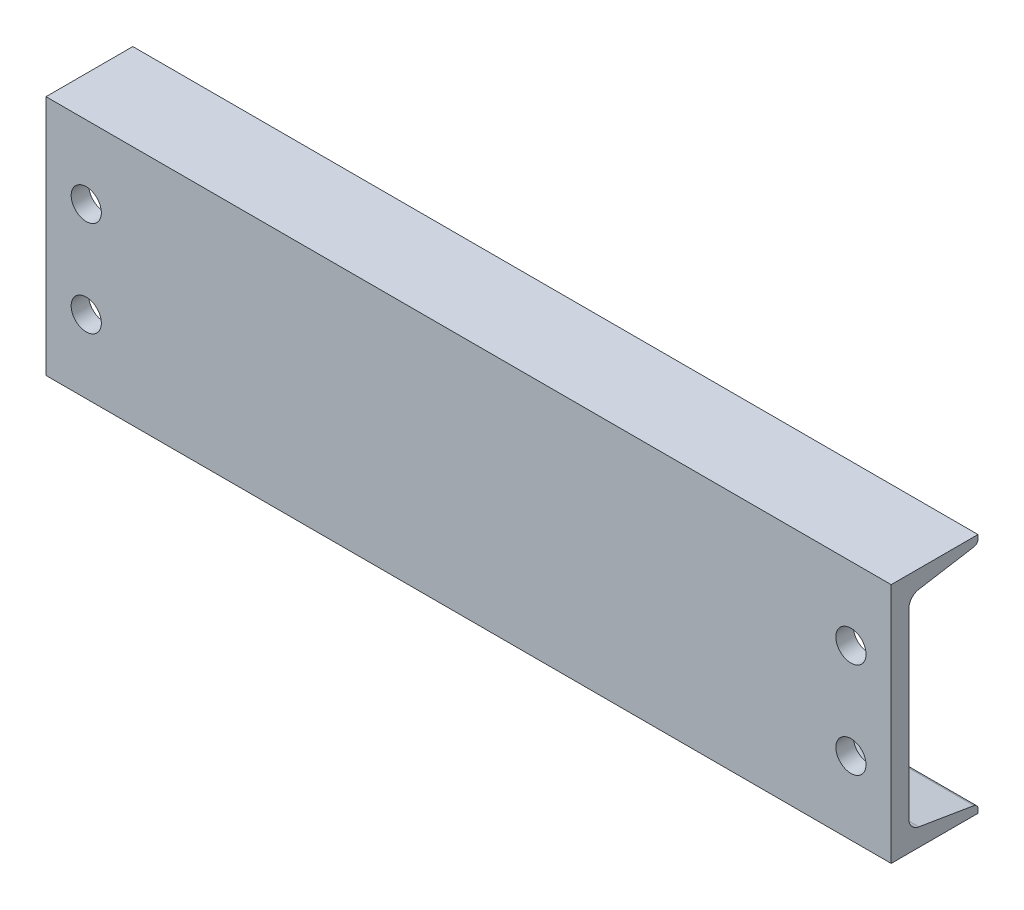
ISO-10303-21;
HEADER;
FILE_DESCRIPTION(('STEP AP214'),'2;1');
FILE_NAME('part.step','',(''),(''),'','','');
FILE_SCHEMA(('AUTOMOTIVE_DESIGN { 1 0 10303 214 1 1 1 1 }'));
ENDSEC;
DATA;
#1=APPLICATION_CONTEXT('core data for automotive mechanical design processes');
#2=APPLICATION_PROTOCOL_DEFINITION('international standard','automotive_design',2000,#1);
#3=PRODUCT_CONTEXT('',#1,'mechanical');
#4=PRODUCT('Part','Part','',(#3));
#5=PRODUCT_RELATED_PRODUCT_CATEGORY('part','',(#4));
#6=PRODUCT_DEFINITION_FORMATION('','',#4);
#7=PRODUCT_DEFINITION_CONTEXT('part definition',#1,'design');
#8=PRODUCT_DEFINITION('design','',#6,#7);
#9=PRODUCT_DEFINITION_SHAPE('','',#8);
#10=(LENGTH_UNIT() NAMED_UNIT(*) SI_UNIT(.MILLI.,.METRE.));
#11=(NAMED_UNIT(*) PLANE_ANGLE_UNIT() SI_UNIT($,.RADIAN.));
#12=(NAMED_UNIT(*) SI_UNIT($,.STERADIAN.) SOLID_ANGLE_UNIT());
#13=UNCERTAINTY_MEASURE_WITH_UNIT(LENGTH_MEASURE(1.E-05),#10,'distance_accuracy_value','');
#14=(GEOMETRIC_REPRESENTATION_CONTEXT(3) GLOBAL_UNCERTAINTY_ASSIGNED_CONTEXT((#13)) GLOBAL_UNIT_ASSIGNED_CONTEXT((#10,
#11,#12)) REPRESENTATION_CONTEXT('',''));
#15=CARTESIAN_POINT('',(0.,0.,0.));
#16=DIRECTION('',(0.,0.,1.));
#17=DIRECTION('',(1.,0.,0.));
#18=AXIS2_PLACEMENT_3D('',#15,#16,#17);
#19=CARTESIAN_POINT('',(266.7,-76.2,27.3939));
#20=DIRECTION('',(0.,1.,0.));
#21=DIRECTION('',(0.,0.,1.));
#22=AXIS2_PLACEMENT_3D('',#19,#20,#21);
#23=PLANE('',#22);
#24=DIRECTION('',(0.,0.,-1.));
#25=VECTOR('',#24,1.);
#26=CARTESIAN_POINT('',(-266.7,-76.2,27.3939));
#27=LINE('',#26,#25);
#28=CARTESIAN_POINT('',(-266.7,-76.2,27.3939));
#29=VERTEX_POINT('',#28);
#30=CARTESIAN_POINT('',(-266.7,-76.2,-27.3939));
#31=VERTEX_POINT('',#30);
#32=EDGE_CURVE('E160',#29,#31,#27,.T.);
#33=ORIENTED_EDGE('',*,*,#32,.T.);
#34=DIRECTION('',(-1.,0.,0.));
#35=VECTOR('',#34,1.);
#36=CARTESIAN_POINT('',(266.7,-76.2,-27.3939));
#37=LINE('',#36,#35);
#38=CARTESIAN_POINT('',(266.7,-76.2,-27.3939));
#39=VERTEX_POINT('',#38);
#40=EDGE_CURVE('E11',#39,#31,#37,.T.);
#41=ORIENTED_EDGE('',*,*,#40,.F.);
#42=DIRECTION('',(0.,0.,-1.));
#43=VECTOR('',#42,1.);
#44=CARTESIAN_POINT('',(266.7,-76.2,27.3939));
#45=LINE('',#44,#43);
#46=CARTESIAN_POINT('',(266.7,-76.2,27.3939));
#47=VERTEX_POINT('',#46);
#48=EDGE_CURVE('E183',#47,#39,#45,.T.);
#49=ORIENTED_EDGE('',*,*,#48,.F.);
#50=DIRECTION('',(-1.,0.,0.));
#51=VECTOR('',#50,1.);
#52=CARTESIAN_POINT('',(266.7,-76.2,27.3939));
#53=LINE('',#52,#51);
#54=EDGE_CURVE('E156',#47,#29,#53,.T.);
#55=ORIENTED_EDGE('',*,*,#54,.T.);
#56=EDGE_LOOP('',(#33,#41,#49,#55));
#57=FACE_BOUND('',#56,.T.);
#58=ADVANCED_FACE('F40',(#57),#23,.F.);
#59=CARTESIAN_POINT('',(266.7,-76.2,-27.3939));
#60=DIRECTION('',(0.,0.,1.));
#61=DIRECTION('',(1.,0.,0.));
#62=AXIS2_PLACEMENT_3D('',#59,#60,#61);
#63=PLANE('',#62);
#64=DIRECTION('',(0.,1.,0.));
#65=VECTOR('',#64,1.);
#66=CARTESIAN_POINT('',(-266.7,-76.2,-27.3939));
#67=LINE('',#66,#65);
#68=CARTESIAN_POINT('',(-266.7,-73.7107446530364,-27.3939));
#69=VERTEX_POINT('',#68);
#70=EDGE_CURVE('E163',#31,#69,#67,.T.);
#71=ORIENTED_EDGE('',*,*,#70,.T.);
#72=DIRECTION('',(-1.,0.,0.));
#73=VECTOR('',#72,1.);
#74=CARTESIAN_POINT('',(266.7,-73.7107446530364,-27.3939));
#75=LINE('',#74,#73);
#76=CARTESIAN_POINT('',(266.7,-73.7107446530364,-27.3939));
#77=VERTEX_POINT('',#76);
#78=EDGE_CURVE('E48',#77,#69,#75,.T.);
#79=ORIENTED_EDGE('',*,*,#78,.F.);
#80=DIRECTION('',(0.,1.,0.));
#81=VECTOR('',#80,1.);
#82=CARTESIAN_POINT('',(266.7,-76.2,-27.3939));
#83=LINE('',#82,#81);
#84=EDGE_CURVE('E111',#39,#77,#83,.T.);
#85=ORIENTED_EDGE('',*,*,#84,.F.);
#86=ORIENTED_EDGE('',*,*,#40,.T.);
#87=EDGE_LOOP('',(#71,#79,#85,#86));
#88=FACE_BOUND('',#87,.T.);
#89=ADVANCED_FACE('F264',(#88),#63,.F.);
#90=CARTESIAN_POINT('',(266.7,-73.7107446530364,-24.3459));
#91=DIRECTION('',(-1.,0.,0.));
#92=DIRECTION('',(0.,0.,1.));
#93=AXIS2_PLACEMENT_3D('',#90,#91,#92);
#94=CYLINDRICAL_SURFACE('',#93,3.04799999999999);
#95=CARTESIAN_POINT('',(-266.7,-73.7107446530364,-24.3459));
#96=DIRECTION('',(1.,0.,0.));
#97=DIRECTION('',(0.,0.,-1.));
#98=AXIS2_PLACEMENT_3D('',#95,#96,#97);
#99=CIRCLE('',#98,3.04799999999999);
#100=CARTESIAN_POINT('',(-266.7,-70.7042219011292,-24.8470236796088));
#101=VERTEX_POINT('',#100);
#102=EDGE_CURVE('E166',#69,#101,#99,.T.);
#103=ORIENTED_EDGE('',*,*,#102,.T.);
#104=DIRECTION('',(-1.,0.,0.));
#105=VECTOR('',#104,1.);
#106=CARTESIAN_POINT('',(266.7,-70.7042219011292,-24.8470236796088));
#107=LINE('',#106,#105);
#108=CARTESIAN_POINT('',(266.7,-70.7042219011292,-24.8470236796088));
#109=VERTEX_POINT('',#108);
#110=EDGE_CURVE('E202',#109,#101,#107,.T.);
#111=ORIENTED_EDGE('',*,*,#110,.F.);
#112=CARTESIAN_POINT('',(266.7,-73.7107446530364,-24.3459));
#113=DIRECTION('',(1.,0.,0.));
#114=DIRECTION('',(0.,0.,-1.));
#115=AXIS2_PLACEMENT_3D('',#112,#113,#114);
#116=CIRCLE('',#115,3.04799999999999);
#117=EDGE_CURVE('E210',#77,#109,#116,.T.);
#118=ORIENTED_EDGE('',*,*,#117,.F.);
#119=ORIENTED_EDGE('',*,*,#78,.T.);
#120=EDGE_LOOP('',(#103,#111,#118,#119));
#121=FACE_BOUND('',#120,.T.);
#122=ADVANCED_FACE('F208',(#121),#94,.T.);
#123=CARTESIAN_POINT('',(266.7,-64.908143628462,9.92690919902199));
#124=DIRECTION('',(0.,-0.986391978972162,0.164410656039631));
#125=DIRECTION('',(0.,-0.164410656039631,-0.986391978972162));
#126=AXIS2_PLACEMENT_3D('',#123,#124,#125);
#127=PLANE('',#126);
#128=DIRECTION('',(0.,0.164410656039631,0.986391978972162));
#129=VECTOR('',#128,1.);
#130=CARTESIAN_POINT('',(-266.7,-64.908143628462,9.92690919902199));
#131=LINE('',#130,#129);
#132=CARTESIAN_POINT('',(-266.7,-64.908143628462,9.92690919902199));
#133=VERTEX_POINT('',#132);
#134=EDGE_CURVE('E168',#101,#133,#131,.T.);
#135=ORIENTED_EDGE('',*,*,#134,.T.);
#136=DIRECTION('',(-1.,0.,0.));
#137=VECTOR('',#136,1.);
#138=CARTESIAN_POINT('',(266.7,-64.908143628462,9.92690919902199));
#139=LINE('',#138,#137);
#140=CARTESIAN_POINT('',(266.7,-64.908143628462,9.92690919902199));
#141=VERTEX_POINT('',#140);
#142=EDGE_CURVE('E199',#141,#133,#139,.T.);
#143=ORIENTED_EDGE('',*,*,#142,.F.);
#144=DIRECTION('',(0.,0.164410656039631,0.986391978972162));
#145=VECTOR('',#144,1.);
#146=CARTESIAN_POINT('',(266.7,-64.908143628462,9.92690919902199));
#147=LINE('',#146,#145);
#148=EDGE_CURVE('E228',#109,#141,#147,.T.);
#149=ORIENTED_EDGE('',*,*,#148,.F.);
#150=ORIENTED_EDGE('',*,*,#110,.T.);
#151=EDGE_LOOP('',(#135,#143,#149,#150));
#152=FACE_BOUND('',#151,.T.);
#153=ADVANCED_FACE('F219',(#152),#127,.F.);
#154=CARTESIAN_POINT('',(266.7,-57.3918367486941,8.67409999999999));
#155=DIRECTION('',(-1.,0.,0.));
#156=DIRECTION('',(0.,0.,1.));
#157=AXIS2_PLACEMENT_3D('',#154,#155,#156);
#158=CYLINDRICAL_SURFACE('',#157,7.62000000000001);
#159=CARTESIAN_POINT('',(-266.7,-57.3918367486941,8.67409999999999));
#160=DIRECTION('',(-1.,0.,0.));
#161=DIRECTION('',(0.,0.,-1.));
#162=AXIS2_PLACEMENT_3D('',#159,#160,#161);
#163=CIRCLE('',#162,7.62000000000001);
#164=CARTESIAN_POINT('',(-266.7,-57.3918367486941,16.2941));
#165=VERTEX_POINT('',#164);
#166=EDGE_CURVE('E170',#133,#165,#163,.T.);
#167=ORIENTED_EDGE('',*,*,#166,.T.);
#168=DIRECTION('',(-1.,0.,0.));
#169=VECTOR('',#168,1.);
#170=CARTESIAN_POINT('',(266.7,-57.3918367486941,16.2941));
#171=LINE('',#170,#169);
#172=CARTESIAN_POINT('',(266.7,-57.3918367486941,16.2941));
#173=VERTEX_POINT('',#172);
#174=EDGE_CURVE('E196',#173,#165,#171,.T.);
#175=ORIENTED_EDGE('',*,*,#174,.F.);
#176=CARTESIAN_POINT('',(266.7,-57.3918367486941,8.67409999999999));
#177=DIRECTION('',(-1.,0.,0.));
#178=DIRECTION('',(0.,0.,-1.));
#179=AXIS2_PLACEMENT_3D('',#176,#177,#178);
#180=CIRCLE('',#179,7.62000000000001);
#181=EDGE_CURVE('E225',#141,#173,#180,.T.);
#182=ORIENTED_EDGE('',*,*,#181,.F.);
#183=ORIENTED_EDGE('',*,*,#142,.T.);
#184=EDGE_LOOP('',(#167,#175,#182,#183));
#185=FACE_BOUND('',#184,.T.);
#186=ADVANCED_FACE('F223',(#185),#158,.F.);
#187=CARTESIAN_POINT('',(266.7,57.3918367486941,16.2941));
#188=DIRECTION('',(0.,0.,1.));
#189=DIRECTION('',(0.,-1.,0.));
#190=AXIS2_PLACEMENT_3D('',#187,#188,#189);
#191=PLANE('',#190);
#192=CARTESIAN_POINT('',(241.3,30.1625,16.2941));
#193=DIRECTION('',(0.,0.,1.));
#194=DIRECTION('',(0.,-1.,0.));
#195=AXIS2_PLACEMENT_3D('',#192,#193,#194);
#196=CIRCLE('',#195,9.525);
#197=CARTESIAN_POINT('',(241.3,20.6375,16.2941));
#198=VERTEX_POINT('',#197);
#199=EDGE_CURVE('E372',#198,#198,#196,.F.);
#200=ORIENTED_EDGE('',*,*,#199,.F.);
#201=EDGE_LOOP('',(#200));
#202=FACE_BOUND('',#201,.T.);
#203=CARTESIAN_POINT('',(241.3,-30.1624999999999,16.2941));
#204=DIRECTION('',(0.,0.,1.));
#205=DIRECTION('',(0.,-1.,0.));
#206=AXIS2_PLACEMENT_3D('',#203,#204,#205);
#207=CIRCLE('',#206,9.525);
#208=CARTESIAN_POINT('',(241.3,-39.6874999999999,16.2941));
#209=VERTEX_POINT('',#208);
#210=EDGE_CURVE('E376',#209,#209,#207,.F.);
#211=ORIENTED_EDGE('',*,*,#210,.F.);
#212=EDGE_LOOP('',(#211));
#213=FACE_BOUND('',#212,.T.);
#214=CARTESIAN_POINT('',(-241.3,-30.1625,16.2941));
#215=DIRECTION('',(0.,0.,1.));
#216=DIRECTION('',(0.,-1.,0.));
#217=AXIS2_PLACEMENT_3D('',#214,#215,#216);
#218=CIRCLE('',#217,9.525);
#219=CARTESIAN_POINT('',(-241.3,-39.6875,16.2941));
#220=VERTEX_POINT('',#219);
#221=EDGE_CURVE('E385',#220,#220,#218,.F.);
#222=ORIENTED_EDGE('',*,*,#221,.F.);
#223=EDGE_LOOP('',(#222));
#224=FACE_BOUND('',#223,.T.);
#225=CARTESIAN_POINT('',(-241.3,30.1625,16.2941));
#226=DIRECTION('',(0.,0.,1.));
#227=DIRECTION('',(0.,-1.,0.));
#228=AXIS2_PLACEMENT_3D('',#225,#226,#227);
#229=CIRCLE('',#228,9.525);
#230=CARTESIAN_POINT('',(-241.3,20.6375,16.2941));
#231=VERTEX_POINT('',#230);
#232=EDGE_CURVE('E164',#231,#231,#229,.F.);
#233=ORIENTED_EDGE('',*,*,#232,.F.);
#234=EDGE_LOOP('',(#233));
#235=FACE_BOUND('',#234,.T.);
#236=DIRECTION('',(0.,1.,0.));
#237=VECTOR('',#236,1.);
#238=CARTESIAN_POINT('',(-266.7,57.3918367486941,16.2941));
#239=LINE('',#238,#237);
#240=CARTESIAN_POINT('',(-266.7,57.3918367486941,16.2941));
#241=VERTEX_POINT('',#240);
#242=EDGE_CURVE('E172',#165,#241,#239,.T.);
#243=ORIENTED_EDGE('',*,*,#242,.T.);
#244=DIRECTION('',(-1.,0.,0.));
#245=VECTOR('',#244,1.);
#246=CARTESIAN_POINT('',(266.7,57.3918367486941,16.2941));
#247=LINE('',#246,#245);
#248=CARTESIAN_POINT('',(266.7,57.3918367486941,16.2941));
#249=VERTEX_POINT('',#248);
#250=EDGE_CURVE('E193',#249,#241,#247,.T.);
#251=ORIENTED_EDGE('',*,*,#250,.F.);
#252=DIRECTION('',(0.,1.,0.));
#253=VECTOR('',#252,1.);
#254=CARTESIAN_POINT('',(266.7,57.3918367486941,16.2941));
#255=LINE('',#254,#253);
#256=EDGE_CURVE('E227',#173,#249,#255,.T.);
#257=ORIENTED_EDGE('',*,*,#256,.F.);
#258=ORIENTED_EDGE('',*,*,#174,.T.);
#259=EDGE_LOOP('',(#243,#251,#257,#258));
#260=FACE_BOUND('',#259,.T.);
#261=ADVANCED_FACE('F277',(#202,#213,#224,#235,#260),#191,.F.);
#262=CARTESIAN_POINT('',(266.7,57.3918367486941,8.6741));
#263=DIRECTION('',(-1.,0.,0.));
#264=DIRECTION('',(0.,0.,1.));
#265=AXIS2_PLACEMENT_3D('',#262,#263,#264);
#266=CYLINDRICAL_SURFACE('',#265,7.62000000000001);
#267=CARTESIAN_POINT('',(-266.7,57.3918367486941,8.6741));
#268=DIRECTION('',(-1.,0.,0.));
#269=DIRECTION('',(0.,0.,1.));
#270=AXIS2_PLACEMENT_3D('',#267,#268,#269);
#271=CIRCLE('',#270,7.62000000000001);
#272=CARTESIAN_POINT('',(-266.7,64.908143628462,9.92690919902198));
#273=VERTEX_POINT('',#272);
#274=EDGE_CURVE('E174',#241,#273,#271,.T.);
#275=ORIENTED_EDGE('',*,*,#274,.T.);
#276=DIRECTION('',(-1.,0.,0.));
#277=VECTOR('',#276,1.);
#278=CARTESIAN_POINT('',(266.7,64.908143628462,9.92690919902198));
#279=LINE('',#278,#277);
#280=CARTESIAN_POINT('',(266.7,64.908143628462,9.92690919902198));
#281=VERTEX_POINT('',#280);
#282=EDGE_CURVE('E190',#281,#273,#279,.T.);
#283=ORIENTED_EDGE('',*,*,#282,.F.);
#284=CARTESIAN_POINT('',(266.7,57.3918367486941,8.6741));
#285=DIRECTION('',(-1.,0.,0.));
#286=DIRECTION('',(0.,0.,1.));
#287=AXIS2_PLACEMENT_3D('',#284,#285,#286);
#288=CIRCLE('',#287,7.62000000000001);
#289=EDGE_CURVE('E230',#249,#281,#288,.T.);
#290=ORIENTED_EDGE('',*,*,#289,.F.);
#291=ORIENTED_EDGE('',*,*,#250,.T.);
#292=EDGE_LOOP('',(#275,#283,#290,#291));
#293=FACE_BOUND('',#292,.T.);
#294=ADVANCED_FACE('F280',(#293),#266,.F.);
#295=CARTESIAN_POINT('',(266.7,64.908143628462,9.92690919902198));
#296=DIRECTION('',(0.,0.986391978972162,0.16441065603963));
#297=DIRECTION('',(0.,-0.16441065603963,0.986391978972162));
#298=AXIS2_PLACEMENT_3D('',#295,#296,#297);
#299=PLANE('',#298);
#300=DIRECTION('',(0.,0.16441065603963,-0.986391978972162));
#301=VECTOR('',#300,1.);
#302=CARTESIAN_POINT('',(-266.7,64.908143628462,9.92690919902198));
#303=LINE('',#302,#301);
#304=CARTESIAN_POINT('',(-266.7,70.7042219011292,-24.8470236796088));
#305=VERTEX_POINT('',#304);
#306=EDGE_CURVE('E176',#273,#305,#303,.T.);
#307=ORIENTED_EDGE('',*,*,#306,.T.);
#308=DIRECTION('',(-1.,0.,0.));
#309=VECTOR('',#308,1.);
#310=CARTESIAN_POINT('',(266.7,70.7042219011292,-24.8470236796088));
#311=LINE('',#310,#309);
#312=CARTESIAN_POINT('',(266.7,70.7042219011292,-24.8470236796088));
#313=VERTEX_POINT('',#312);
#314=EDGE_CURVE('E187',#313,#305,#311,.T.);
#315=ORIENTED_EDGE('',*,*,#314,.F.);
#316=DIRECTION('',(0.,0.16441065603963,-0.986391978972162));
#317=VECTOR('',#316,1.);
#318=CARTESIAN_POINT('',(266.7,64.908143628462,9.92690919902198));
#319=LINE('',#318,#317);
#320=EDGE_CURVE('E236',#281,#313,#319,.T.);
#321=ORIENTED_EDGE('',*,*,#320,.F.);
#322=ORIENTED_EDGE('',*,*,#282,.T.);
#323=EDGE_LOOP('',(#307,#315,#321,#322));
#324=FACE_BOUND('',#323,.T.);
#325=ADVANCED_FACE('F242',(#324),#299,.F.);
#326=CARTESIAN_POINT('',(266.7,73.7107446530364,-24.3459));
#327=DIRECTION('',(-1.,0.,0.));
#328=DIRECTION('',(0.,0.,1.));
#329=AXIS2_PLACEMENT_3D('',#326,#327,#328);
#330=CYLINDRICAL_SURFACE('',#329,3.048);
#331=CARTESIAN_POINT('',(-266.7,73.7107446530364,-24.3459));
#332=DIRECTION('',(1.,0.,0.));
#333=DIRECTION('',(0.,0.,1.));
#334=AXIS2_PLACEMENT_3D('',#331,#332,#333);
#335=CIRCLE('',#334,3.048);
#336=CARTESIAN_POINT('',(-266.7,73.7107446530364,-27.3939));
#337=VERTEX_POINT('',#336);
#338=EDGE_CURVE('E178',#305,#337,#335,.T.);
#339=ORIENTED_EDGE('',*,*,#338,.T.);
#340=DIRECTION('',(-1.,0.,0.));
#341=VECTOR('',#340,1.);
#342=CARTESIAN_POINT('',(266.7,73.7107446530364,-27.3939));
#343=LINE('',#342,#341);
#344=CARTESIAN_POINT('',(266.7,73.7107446530364,-27.3939));
#345=VERTEX_POINT('',#344);
#346=EDGE_CURVE('E151',#345,#337,#343,.T.);
#347=ORIENTED_EDGE('',*,*,#346,.F.);
#348=CARTESIAN_POINT('',(266.7,73.7107446530364,-24.3459));
#349=DIRECTION('',(1.,0.,0.));
#350=DIRECTION('',(0.,0.,1.));
#351=AXIS2_PLACEMENT_3D('',#348,#349,#350);
#352=CIRCLE('',#351,3.048);
#353=EDGE_CURVE('E142',#313,#345,#352,.T.);
#354=ORIENTED_EDGE('',*,*,#353,.F.);
#355=ORIENTED_EDGE('',*,*,#314,.T.);
#356=EDGE_LOOP('',(#339,#347,#354,#355));
#357=FACE_BOUND('',#356,.T.);
#358=ADVANCED_FACE('F246',(#357),#330,.T.);
#359=CARTESIAN_POINT('',(266.7,76.2,-27.3939));
#360=DIRECTION('',(0.,0.,1.));
#361=DIRECTION('',(0.,-1.,0.));
#362=AXIS2_PLACEMENT_3D('',#359,#360,#361);
#363=PLANE('',#362);
#364=DIRECTION('',(0.,1.,0.));
#365=VECTOR('',#364,1.);
#366=CARTESIAN_POINT('',(-266.7,76.2,-27.3939));
#367=LINE('',#366,#365);
#368=CARTESIAN_POINT('',(-266.7,76.2,-27.3939));
#369=VERTEX_POINT('',#368);
#370=EDGE_CURVE('E150',#337,#369,#367,.T.);
#371=ORIENTED_EDGE('',*,*,#370,.T.);
#372=DIRECTION('',(-1.,0.,0.));
#373=VECTOR('',#372,1.);
#374=CARTESIAN_POINT('',(266.7,76.2,-27.3939));
#375=LINE('',#374,#373);
#376=CARTESIAN_POINT('',(266.7,76.2,-27.3939));
#377=VERTEX_POINT('',#376);
#378=EDGE_CURVE('E147',#377,#369,#375,.T.);
#379=ORIENTED_EDGE('',*,*,#378,.F.);
#380=DIRECTION('',(0.,1.,0.));
#381=VECTOR('',#380,1.);
#382=CARTESIAN_POINT('',(266.7,76.2,-27.3939));
#383=LINE('',#382,#381);
#384=EDGE_CURVE('E136',#345,#377,#383,.T.);
#385=ORIENTED_EDGE('',*,*,#384,.F.);
#386=ORIENTED_EDGE('',*,*,#346,.T.);
#387=EDGE_LOOP('',(#371,#379,#385,#386));
#388=FACE_BOUND('',#387,.T.);
#389=ADVANCED_FACE('F148',(#388),#363,.F.);
#390=CARTESIAN_POINT('',(266.7,76.2,27.3939));
#391=DIRECTION('',(0.,-1.,0.));
#392=DIRECTION('',(0.,0.,-1.));
#393=AXIS2_PLACEMENT_3D('',#390,#391,#392);
#394=PLANE('',#393);
#395=DIRECTION('',(0.,0.,1.));
#396=VECTOR('',#395,1.);
#397=CARTESIAN_POINT('',(-266.7,76.2,27.3939));
#398=LINE('',#397,#396);
#399=CARTESIAN_POINT('',(-266.7,76.2,27.3939));
#400=VERTEX_POINT('',#399);
#401=EDGE_CURVE('E97',#369,#400,#398,.T.);
#402=ORIENTED_EDGE('',*,*,#401,.T.);
#403=DIRECTION('',(-1.,0.,0.));
#404=VECTOR('',#403,1.);
#405=CARTESIAN_POINT('',(266.7,76.2,27.3939));
#406=LINE('',#405,#404);
#407=CARTESIAN_POINT('',(266.7,76.2,27.3939));
#408=VERTEX_POINT('',#407);
#409=EDGE_CURVE('E152',#408,#400,#406,.T.);
#410=ORIENTED_EDGE('',*,*,#409,.F.);
#411=DIRECTION('',(0.,0.,1.));
#412=VECTOR('',#411,1.);
#413=CARTESIAN_POINT('',(266.7,76.2,27.3939));
#414=LINE('',#413,#412);
#415=EDGE_CURVE('E140',#377,#408,#414,.T.);
#416=ORIENTED_EDGE('',*,*,#415,.F.);
#417=ORIENTED_EDGE('',*,*,#378,.T.);
#418=EDGE_LOOP('',(#402,#410,#416,#417));
#419=FACE_BOUND('',#418,.T.);
#420=ADVANCED_FACE('F154',(#419),#394,.F.);
#421=CARTESIAN_POINT('',(266.7,-76.2,27.3939));
#422=DIRECTION('',(0.,0.,-1.));
#423=DIRECTION('',(-1.,0.,0.));
#424=AXIS2_PLACEMENT_3D('',#421,#422,#423);
#425=PLANE('',#424);
#426=CARTESIAN_POINT('',(241.3,30.1625,27.3939));
#427=DIRECTION('',(0.,0.,1.));
#428=DIRECTION('',(-1.,0.,0.));
#429=AXIS2_PLACEMENT_3D('',#426,#427,#428);
#430=CIRCLE('',#429,9.525);
#431=CARTESIAN_POINT('',(231.775,30.1625,27.3939));
#432=VERTEX_POINT('',#431);
#433=EDGE_CURVE('E369',#432,#432,#430,.T.);
#434=ORIENTED_EDGE('',*,*,#433,.F.);
#435=EDGE_LOOP('',(#434));
#436=FACE_BOUND('',#435,.T.);
#437=CARTESIAN_POINT('',(241.3,-30.1624999999999,27.3939));
#438=DIRECTION('',(0.,0.,1.));
#439=DIRECTION('',(1.,0.,0.));
#440=AXIS2_PLACEMENT_3D('',#437,#438,#439);
#441=CIRCLE('',#440,9.525);
#442=CARTESIAN_POINT('',(250.825,-30.1624999999999,27.3939));
#443=VERTEX_POINT('',#442);
#444=EDGE_CURVE('E373',#443,#443,#441,.T.);
#445=ORIENTED_EDGE('',*,*,#444,.F.);
#446=EDGE_LOOP('',(#445));
#447=FACE_BOUND('',#446,.T.);
#448=CARTESIAN_POINT('',(-241.3,-30.1625,27.3939));
#449=DIRECTION('',(0.,0.,1.));
#450=DIRECTION('',(-1.,0.,0.));
#451=AXIS2_PLACEMENT_3D('',#448,#449,#450);
#452=CIRCLE('',#451,9.525);
#453=CARTESIAN_POINT('',(-250.825,-30.1625,27.3939));
#454=VERTEX_POINT('',#453);
#455=EDGE_CURVE('E382',#454,#454,#452,.T.);
#456=ORIENTED_EDGE('',*,*,#455,.F.);
#457=EDGE_LOOP('',(#456));
#458=FACE_BOUND('',#457,.T.);
#459=CARTESIAN_POINT('',(-241.3,30.1625,27.3939));
#460=DIRECTION('',(0.,0.,1.));
#461=DIRECTION('',(1.,0.,0.));
#462=AXIS2_PLACEMENT_3D('',#459,#460,#461);
#463=CIRCLE('',#462,9.525);
#464=CARTESIAN_POINT('',(-231.775,30.1625,27.3939));
#465=VERTEX_POINT('',#464);
#466=EDGE_CURVE('E388',#465,#465,#463,.T.);
#467=ORIENTED_EDGE('',*,*,#466,.F.);
#468=EDGE_LOOP('',(#467));
#469=FACE_BOUND('',#468,.T.);
#470=DIRECTION('',(0.,-1.,0.));
#471=VECTOR('',#470,1.);
#472=CARTESIAN_POINT('',(-266.7,-76.2,27.3939));
#473=LINE('',#472,#471);
#474=EDGE_CURVE('E103',#400,#29,#473,.T.);
#475=ORIENTED_EDGE('',*,*,#474,.T.);
#476=ORIENTED_EDGE('',*,*,#54,.F.);
#477=DIRECTION('',(0.,-1.,0.));
#478=VECTOR('',#477,1.);
#479=CARTESIAN_POINT('',(266.7,-76.2,27.3939));
#480=LINE('',#479,#478);
#481=EDGE_CURVE('E56',#408,#47,#480,.T.);
#482=ORIENTED_EDGE('',*,*,#481,.F.);
#483=ORIENTED_EDGE('',*,*,#409,.T.);
#484=EDGE_LOOP('',(#475,#476,#482,#483));
#485=FACE_BOUND('',#484,.T.);
#486=ADVANCED_FACE('F250',(#436,#447,#458,#469,#485),#425,.F.);
#487=CARTESIAN_POINT('',(266.7,-73.7107446530364,-24.3459));
#488=DIRECTION('',(1.,0.,0.));
#489=DIRECTION('',(0.,0.,-1.));
#490=AXIS2_PLACEMENT_3D('',#487,#488,#489);
#491=PLANE('',#490);
#492=ORIENTED_EDGE('',*,*,#48,.T.);
#493=ORIENTED_EDGE('',*,*,#84,.T.);
#494=ORIENTED_EDGE('',*,*,#117,.T.);
#495=ORIENTED_EDGE('',*,*,#148,.T.);
#496=ORIENTED_EDGE('',*,*,#181,.T.);
#497=ORIENTED_EDGE('',*,*,#256,.T.);
#498=ORIENTED_EDGE('',*,*,#289,.T.);
#499=ORIENTED_EDGE('',*,*,#320,.T.);
#500=ORIENTED_EDGE('',*,*,#353,.T.);
#501=ORIENTED_EDGE('',*,*,#384,.T.);
#502=ORIENTED_EDGE('',*,*,#415,.T.);
#503=ORIENTED_EDGE('',*,*,#481,.T.);
#504=EDGE_LOOP('',(#492,#493,#494,#495,#496,#497,#498,#499,#500,#501,#502,#503));
#505=FACE_BOUND('',#504,.T.);
#506=ADVANCED_FACE('F138',(#505),#491,.T.);
#507=CARTESIAN_POINT('',(-266.7,-73.7107446530364,-24.3459));
#508=DIRECTION('',(1.,0.,0.));
#509=DIRECTION('',(0.,0.,-1.));
#510=AXIS2_PLACEMENT_3D('',#507,#508,#509);
#511=PLANE('',#510);
#512=ORIENTED_EDGE('',*,*,#32,.F.);
#513=ORIENTED_EDGE('',*,*,#474,.F.);
#514=ORIENTED_EDGE('',*,*,#401,.F.);
#515=ORIENTED_EDGE('',*,*,#370,.F.);
#516=ORIENTED_EDGE('',*,*,#338,.F.);
#517=ORIENTED_EDGE('',*,*,#306,.F.);
#518=ORIENTED_EDGE('',*,*,#274,.F.);
#519=ORIENTED_EDGE('',*,*,#242,.F.);
#520=ORIENTED_EDGE('',*,*,#166,.F.);
#521=ORIENTED_EDGE('',*,*,#134,.F.);
#522=ORIENTED_EDGE('',*,*,#102,.F.);
#523=ORIENTED_EDGE('',*,*,#70,.F.);
#524=EDGE_LOOP('',(#512,#513,#514,#515,#516,#517,#518,#519,#520,#521,#522,#523));
#525=FACE_BOUND('',#524,.T.);
#526=ADVANCED_FACE('F214',(#525),#511,.F.);
#527=CARTESIAN_POINT('',(-241.3,30.1625,-27.3949));
#528=DIRECTION('',(0.,0.,1.));
#529=DIRECTION('',(1.,0.,0.));
#530=AXIS2_PLACEMENT_3D('',#527,#528,#529);
#531=CYLINDRICAL_SURFACE('',#530,9.525);
#532=ORIENTED_EDGE('',*,*,#466,.T.);
#533=EDGE_LOOP('',(#532));
#534=FACE_BOUND('',#533,.T.);
#535=ORIENTED_EDGE('',*,*,#232,.T.);
#536=EDGE_LOOP('',(#535));
#537=FACE_BOUND('',#536,.T.);
#538=ADVANCED_FACE('F314',(#534,#537),#531,.F.);
#539=CARTESIAN_POINT('',(-241.3,-30.1625,-27.3949));
#540=DIRECTION('',(0.,0.,1.));
#541=DIRECTION('',(1.,0.,0.));
#542=AXIS2_PLACEMENT_3D('',#539,#540,#541);
#543=CYLINDRICAL_SURFACE('',#542,9.525);
#544=ORIENTED_EDGE('',*,*,#455,.T.);
#545=EDGE_LOOP('',(#544));
#546=FACE_BOUND('',#545,.T.);
#547=ORIENTED_EDGE('',*,*,#221,.T.);
#548=EDGE_LOOP('',(#547));
#549=FACE_BOUND('',#548,.T.);
#550=ADVANCED_FACE('F333',(#546,#549),#543,.F.);
#551=CARTESIAN_POINT('',(241.3,-30.1624999999999,-27.3949));
#552=DIRECTION('',(0.,0.,1.));
#553=DIRECTION('',(1.,0.,0.));
#554=AXIS2_PLACEMENT_3D('',#551,#552,#553);
#555=CYLINDRICAL_SURFACE('',#554,9.525);
#556=ORIENTED_EDGE('',*,*,#444,.T.);
#557=EDGE_LOOP('',(#556));
#558=FACE_BOUND('',#557,.T.);
#559=ORIENTED_EDGE('',*,*,#210,.T.);
#560=EDGE_LOOP('',(#559));
#561=FACE_BOUND('',#560,.T.);
#562=ADVANCED_FACE('F343',(#558,#561),#555,.F.);
#563=CARTESIAN_POINT('',(241.3,30.1625,-27.3949));
#564=DIRECTION('',(0.,0.,1.));
#565=DIRECTION('',(1.,0.,0.));
#566=AXIS2_PLACEMENT_3D('',#563,#564,#565);
#567=CYLINDRICAL_SURFACE('',#566,9.525);
#568=ORIENTED_EDGE('',*,*,#433,.T.);
#569=EDGE_LOOP('',(#568));
#570=FACE_BOUND('',#569,.T.);
#571=ORIENTED_EDGE('',*,*,#199,.T.);
#572=EDGE_LOOP('',(#571));
#573=FACE_BOUND('',#572,.T.);
#574=ADVANCED_FACE('F353',(#570,#573),#567,.F.);
#575=CLOSED_SHELL('',(#58,#89,#122,#153,#186,#261,#294,#325,#358,#389,#420,#486,#506,#526,#538,
#550,#562,#574));
#576=MANIFOLD_SOLID_BREP('B2',#575);
#577=ADVANCED_BREP_SHAPE_REPRESENTATION('',(#18,#576),#14);
#578=SHAPE_DEFINITION_REPRESENTATION(#9,#577);
ENDSEC;
END-ISO-10303-21;
